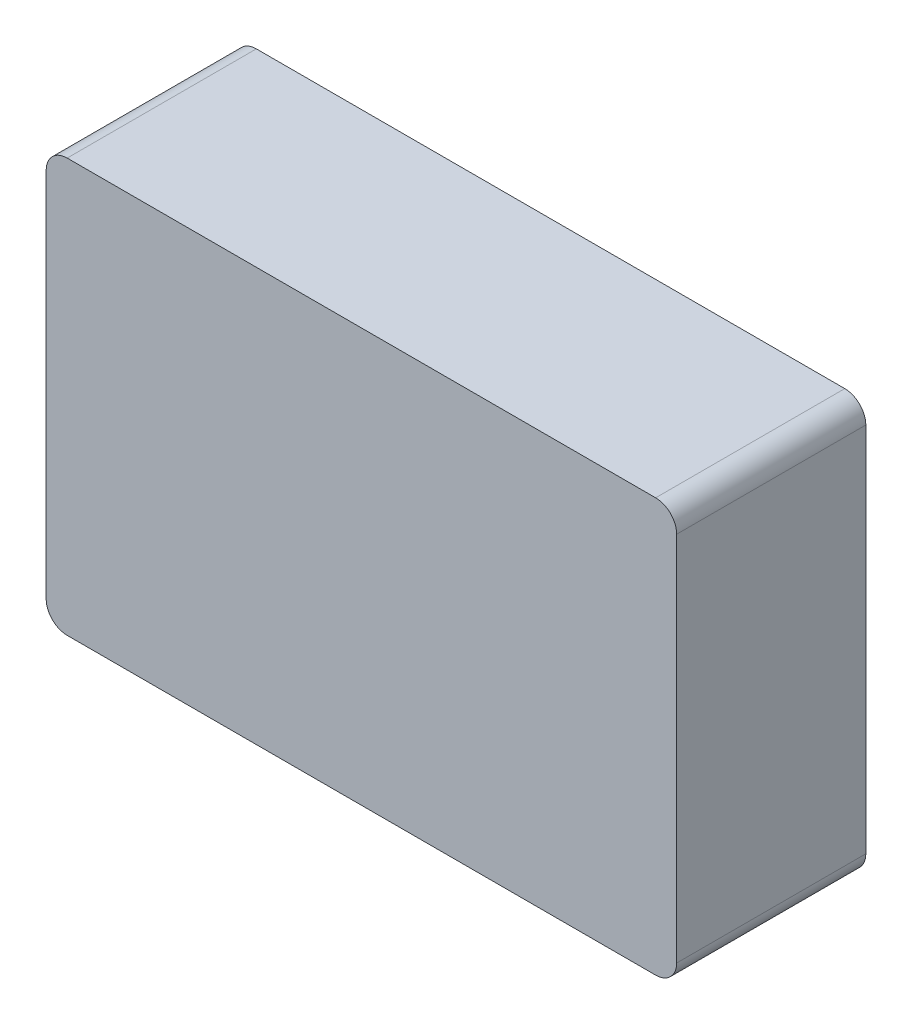
ISO-10303-21;
HEADER;
FILE_DESCRIPTION(('STEP AP214'),'2;1');
FILE_NAME('part.step','',(''),(''),'','','');
FILE_SCHEMA(('AUTOMOTIVE_DESIGN { 1 0 10303 214 1 1 1 1 }'));
ENDSEC;
DATA;
#1=APPLICATION_CONTEXT('core data for automotive mechanical design processes');
#2=APPLICATION_PROTOCOL_DEFINITION('international standard','automotive_design',2000,#1);
#3=PRODUCT_CONTEXT('',#1,'mechanical');
#4=PRODUCT('Part','Part','',(#3));
#5=PRODUCT_RELATED_PRODUCT_CATEGORY('part','',(#4));
#6=PRODUCT_DEFINITION_FORMATION('','',#4);
#7=PRODUCT_DEFINITION_CONTEXT('part definition',#1,'design');
#8=PRODUCT_DEFINITION('design','',#6,#7);
#9=PRODUCT_DEFINITION_SHAPE('','',#8);
#10=(LENGTH_UNIT() NAMED_UNIT(*) SI_UNIT(.MILLI.,.METRE.));
#11=(NAMED_UNIT(*) PLANE_ANGLE_UNIT() SI_UNIT($,.RADIAN.));
#12=(NAMED_UNIT(*) SI_UNIT($,.STERADIAN.) SOLID_ANGLE_UNIT());
#13=UNCERTAINTY_MEASURE_WITH_UNIT(LENGTH_MEASURE(1.E-05),#10,'distance_accuracy_value','');
#14=(GEOMETRIC_REPRESENTATION_CONTEXT(3) GLOBAL_UNCERTAINTY_ASSIGNED_CONTEXT((#13)) GLOBAL_UNIT_ASSIGNED_CONTEXT((#10,
#11,#12)) REPRESENTATION_CONTEXT('',''));
#15=CARTESIAN_POINT('',(0.,0.,0.));
#16=DIRECTION('',(0.,0.,1.));
#17=DIRECTION('',(1.,0.,0.));
#18=AXIS2_PLACEMENT_3D('',#15,#16,#17);
#19=CARTESIAN_POINT('',(-14.,-8.8349613483669,9.));
#20=DIRECTION('',(0.,0.,-1.));
#21=DIRECTION('',(-1.,0.,0.));
#22=AXIS2_PLACEMENT_3D('',#19,#20,#21);
#23=CYLINDRICAL_SURFACE('',#22,0.999999999999999);
#24=CARTESIAN_POINT('',(-14.,-8.8349613483669,0.));
#25=DIRECTION('',(0.,0.,1.));
#26=DIRECTION('',(-1.,0.,0.));
#27=AXIS2_PLACEMENT_3D('',#24,#25,#26);
#28=CIRCLE('',#27,0.999999999999999);
#29=CARTESIAN_POINT('',(-15.,-8.83496134836689,0.));
#30=VERTEX_POINT('',#29);
#31=CARTESIAN_POINT('',(-14.,-9.8349613483669,0.));
#32=VERTEX_POINT('',#31);
#33=EDGE_CURVE('E146',#30,#32,#28,.T.);
#34=ORIENTED_EDGE('',*,*,#33,.T.);
#35=DIRECTION('',(0.,0.,-1.));
#36=VECTOR('',#35,1.);
#37=CARTESIAN_POINT('',(-14.,-9.8349613483669,9.));
#38=LINE('',#37,#36);
#39=CARTESIAN_POINT('',(-14.,-9.8349613483669,9.));
#40=VERTEX_POINT('',#39);
#41=EDGE_CURVE('E11',#40,#32,#38,.T.);
#42=ORIENTED_EDGE('',*,*,#41,.F.);
#43=CARTESIAN_POINT('',(-14.,-8.8349613483669,9.));
#44=DIRECTION('',(0.,0.,1.));
#45=DIRECTION('',(-1.,0.,0.));
#46=AXIS2_PLACEMENT_3D('',#43,#44,#45);
#47=CIRCLE('',#46,0.999999999999999);
#48=CARTESIAN_POINT('',(-15.,-8.83496134836689,9.));
#49=VERTEX_POINT('',#48);
#50=EDGE_CURVE('E168',#49,#40,#47,.T.);
#51=ORIENTED_EDGE('',*,*,#50,.F.);
#52=DIRECTION('',(0.,0.,-1.));
#53=VECTOR('',#52,1.);
#54=CARTESIAN_POINT('',(-15.,-8.83496134836689,9.));
#55=LINE('',#54,#53);
#56=EDGE_CURVE('E142',#49,#30,#55,.T.);
#57=ORIENTED_EDGE('',*,*,#56,.T.);
#58=EDGE_LOOP('',(#34,#42,#51,#57));
#59=FACE_BOUND('',#58,.T.);
#60=ADVANCED_FACE('F45',(#59),#23,.T.);
#61=CARTESIAN_POINT('',(-14.,-9.8349613483669,9.));
#62=DIRECTION('',(0.,1.,0.));
#63=DIRECTION('',(0.,0.,1.));
#64=AXIS2_PLACEMENT_3D('',#61,#62,#63);
#65=PLANE('',#64);
#66=DIRECTION('',(1.,0.,0.));
#67=VECTOR('',#66,1.);
#68=CARTESIAN_POINT('',(-14.,-9.8349613483669,0.));
#69=LINE('',#68,#67);
#70=CARTESIAN_POINT('',(14.,-9.8349613483669,0.));
#71=VERTEX_POINT('',#70);
#72=EDGE_CURVE('E150',#32,#71,#69,.T.);
#73=ORIENTED_EDGE('',*,*,#72,.T.);
#74=DIRECTION('',(0.,0.,-1.));
#75=VECTOR('',#74,1.);
#76=CARTESIAN_POINT('',(14.,-9.8349613483669,9.));
#77=LINE('',#76,#75);
#78=CARTESIAN_POINT('',(14.,-9.8349613483669,9.));
#79=VERTEX_POINT('',#78);
#80=EDGE_CURVE('E54',#79,#71,#77,.T.);
#81=ORIENTED_EDGE('',*,*,#80,.F.);
#82=DIRECTION('',(1.,0.,0.));
#83=VECTOR('',#82,1.);
#84=CARTESIAN_POINT('',(-14.,-9.8349613483669,9.));
#85=LINE('',#84,#83);
#86=EDGE_CURVE('E105',#40,#79,#85,.T.);
#87=ORIENTED_EDGE('',*,*,#86,.F.);
#88=ORIENTED_EDGE('',*,*,#41,.T.);
#89=EDGE_LOOP('',(#73,#81,#87,#88));
#90=FACE_BOUND('',#89,.T.);
#91=ADVANCED_FACE('F214',(#90),#65,.F.);
#92=CARTESIAN_POINT('',(14.,-8.8349613483669,9.));
#93=DIRECTION('',(0.,0.,-1.));
#94=DIRECTION('',(-1.,0.,0.));
#95=AXIS2_PLACEMENT_3D('',#92,#93,#94);
#96=CYLINDRICAL_SURFACE('',#95,0.999999999999999);
#97=CARTESIAN_POINT('',(14.,-8.8349613483669,0.));
#98=DIRECTION('',(0.,0.,1.));
#99=DIRECTION('',(1.,0.,0.));
#100=AXIS2_PLACEMENT_3D('',#97,#98,#99);
#101=CIRCLE('',#100,0.999999999999999);
#102=CARTESIAN_POINT('',(15.,-8.8349613483669,0.));
#103=VERTEX_POINT('',#102);
#104=EDGE_CURVE('E153',#71,#103,#101,.T.);
#105=ORIENTED_EDGE('',*,*,#104,.T.);
#106=DIRECTION('',(0.,0.,-1.));
#107=VECTOR('',#106,1.);
#108=CARTESIAN_POINT('',(15.,-8.8349613483669,9.));
#109=LINE('',#108,#107);
#110=CARTESIAN_POINT('',(15.,-8.8349613483669,9.));
#111=VERTEX_POINT('',#110);
#112=EDGE_CURVE('E179',#111,#103,#109,.T.);
#113=ORIENTED_EDGE('',*,*,#112,.F.);
#114=CARTESIAN_POINT('',(14.,-8.8349613483669,9.));
#115=DIRECTION('',(0.,0.,1.));
#116=DIRECTION('',(1.,0.,0.));
#117=AXIS2_PLACEMENT_3D('',#114,#115,#116);
#118=CIRCLE('',#117,0.999999999999999);
#119=EDGE_CURVE('E189',#79,#111,#118,.T.);
#120=ORIENTED_EDGE('',*,*,#119,.F.);
#121=ORIENTED_EDGE('',*,*,#80,.T.);
#122=EDGE_LOOP('',(#105,#113,#120,#121));
#123=FACE_BOUND('',#122,.T.);
#124=ADVANCED_FACE('F187',(#123),#96,.T.);
#125=CARTESIAN_POINT('',(15.,-8.83496134836689,9.));
#126=DIRECTION('',(-1.,0.,0.));
#127=DIRECTION('',(0.,0.,1.));
#128=AXIS2_PLACEMENT_3D('',#125,#126,#127);
#129=PLANE('',#128);
#130=DIRECTION('',(0.,1.,0.));
#131=VECTOR('',#130,1.);
#132=CARTESIAN_POINT('',(15.,-8.83496134836689,0.));
#133=LINE('',#132,#131);
#134=CARTESIAN_POINT('',(15.,8.83496134836689,0.));
#135=VERTEX_POINT('',#134);
#136=EDGE_CURVE('E156',#103,#135,#133,.T.);
#137=ORIENTED_EDGE('',*,*,#136,.T.);
#138=DIRECTION('',(0.,0.,-1.));
#139=VECTOR('',#138,1.);
#140=CARTESIAN_POINT('',(15.,8.83496134836689,9.));
#141=LINE('',#140,#139);
#142=CARTESIAN_POINT('',(15.,8.83496134836689,9.));
#143=VERTEX_POINT('',#142);
#144=EDGE_CURVE('E175',#143,#135,#141,.T.);
#145=ORIENTED_EDGE('',*,*,#144,.F.);
#146=DIRECTION('',(0.,1.,0.));
#147=VECTOR('',#146,1.);
#148=CARTESIAN_POINT('',(15.,-8.83496134836689,9.));
#149=LINE('',#148,#147);
#150=EDGE_CURVE('E202',#111,#143,#149,.T.);
#151=ORIENTED_EDGE('',*,*,#150,.F.);
#152=ORIENTED_EDGE('',*,*,#112,.T.);
#153=EDGE_LOOP('',(#137,#145,#151,#152));
#154=FACE_BOUND('',#153,.T.);
#155=ADVANCED_FACE('F197',(#154),#129,.F.);
#156=CARTESIAN_POINT('',(14.,8.8349613483669,9.));
#157=DIRECTION('',(0.,0.,-1.));
#158=DIRECTION('',(-1.,0.,0.));
#159=AXIS2_PLACEMENT_3D('',#156,#157,#158);
#160=CYLINDRICAL_SURFACE('',#159,0.999999999999999);
#161=CARTESIAN_POINT('',(14.,8.8349613483669,0.));
#162=DIRECTION('',(0.,0.,1.));
#163=DIRECTION('',(-1.,0.,0.));
#164=AXIS2_PLACEMENT_3D('',#161,#162,#163);
#165=CIRCLE('',#164,0.999999999999999);
#166=CARTESIAN_POINT('',(14.,9.8349613483669,0.));
#167=VERTEX_POINT('',#166);
#168=EDGE_CURVE('E159',#135,#167,#165,.T.);
#169=ORIENTED_EDGE('',*,*,#168,.T.);
#170=DIRECTION('',(0.,0.,-1.));
#171=VECTOR('',#170,1.);
#172=CARTESIAN_POINT('',(14.,9.8349613483669,9.));
#173=LINE('',#172,#171);
#174=CARTESIAN_POINT('',(14.,9.8349613483669,9.));
#175=VERTEX_POINT('',#174);
#176=EDGE_CURVE('E135',#175,#167,#173,.T.);
#177=ORIENTED_EDGE('',*,*,#176,.F.);
#178=CARTESIAN_POINT('',(14.,8.8349613483669,9.));
#179=DIRECTION('',(0.,0.,1.));
#180=DIRECTION('',(-1.,0.,0.));
#181=AXIS2_PLACEMENT_3D('',#178,#179,#180);
#182=CIRCLE('',#181,0.999999999999999);
#183=EDGE_CURVE('E124',#143,#175,#182,.T.);
#184=ORIENTED_EDGE('',*,*,#183,.F.);
#185=ORIENTED_EDGE('',*,*,#144,.T.);
#186=EDGE_LOOP('',(#169,#177,#184,#185));
#187=FACE_BOUND('',#186,.T.);
#188=ADVANCED_FACE('F200',(#187),#160,.T.);
#189=CARTESIAN_POINT('',(-14.,9.8349613483669,9.));
#190=DIRECTION('',(0.,-1.,0.));
#191=DIRECTION('',(0.,0.,-1.));
#192=AXIS2_PLACEMENT_3D('',#189,#190,#191);
#193=PLANE('',#192);
#194=DIRECTION('',(-1.,0.,0.));
#195=VECTOR('',#194,1.);
#196=CARTESIAN_POINT('',(-14.,9.8349613483669,0.));
#197=LINE('',#196,#195);
#198=CARTESIAN_POINT('',(-14.,9.8349613483669,0.));
#199=VERTEX_POINT('',#198);
#200=EDGE_CURVE('E133',#167,#199,#197,.T.);
#201=ORIENTED_EDGE('',*,*,#200,.T.);
#202=DIRECTION('',(0.,0.,-1.));
#203=VECTOR('',#202,1.);
#204=CARTESIAN_POINT('',(-14.,9.8349613483669,9.));
#205=LINE('',#204,#203);
#206=CARTESIAN_POINT('',(-14.,9.8349613483669,9.));
#207=VERTEX_POINT('',#206);
#208=EDGE_CURVE('E130',#207,#199,#205,.T.);
#209=ORIENTED_EDGE('',*,*,#208,.F.);
#210=DIRECTION('',(-1.,0.,0.));
#211=VECTOR('',#210,1.);
#212=CARTESIAN_POINT('',(-14.,9.8349613483669,9.));
#213=LINE('',#212,#211);
#214=EDGE_CURVE('E118',#175,#207,#213,.T.);
#215=ORIENTED_EDGE('',*,*,#214,.F.);
#216=ORIENTED_EDGE('',*,*,#176,.T.);
#217=EDGE_LOOP('',(#201,#209,#215,#216));
#218=FACE_BOUND('',#217,.T.);
#219=ADVANCED_FACE('F131',(#218),#193,.F.);
#220=CARTESIAN_POINT('',(-14.,8.8349613483669,9.));
#221=DIRECTION('',(0.,0.,-1.));
#222=DIRECTION('',(-1.,0.,0.));
#223=AXIS2_PLACEMENT_3D('',#220,#221,#222);
#224=CYLINDRICAL_SURFACE('',#223,0.999999999999999);
#225=CARTESIAN_POINT('',(-14.,8.8349613483669,0.));
#226=DIRECTION('',(0.,0.,1.));
#227=DIRECTION('',(-1.,0.,0.));
#228=AXIS2_PLACEMENT_3D('',#225,#226,#227);
#229=CIRCLE('',#228,0.999999999999999);
#230=CARTESIAN_POINT('',(-15.,8.83496134836689,0.));
#231=VERTEX_POINT('',#230);
#232=EDGE_CURVE('E91',#199,#231,#229,.T.);
#233=ORIENTED_EDGE('',*,*,#232,.T.);
#234=DIRECTION('',(0.,0.,-1.));
#235=VECTOR('',#234,1.);
#236=CARTESIAN_POINT('',(-15.,8.83496134836689,9.));
#237=LINE('',#236,#235);
#238=CARTESIAN_POINT('',(-15.,8.83496134836689,9.));
#239=VERTEX_POINT('',#238);
#240=EDGE_CURVE('E136',#239,#231,#237,.T.);
#241=ORIENTED_EDGE('',*,*,#240,.F.);
#242=CARTESIAN_POINT('',(-14.,8.8349613483669,9.));
#243=DIRECTION('',(0.,0.,1.));
#244=DIRECTION('',(-1.,0.,0.));
#245=AXIS2_PLACEMENT_3D('',#242,#243,#244);
#246=CIRCLE('',#245,0.999999999999999);
#247=EDGE_CURVE('E122',#207,#239,#246,.T.);
#248=ORIENTED_EDGE('',*,*,#247,.F.);
#249=ORIENTED_EDGE('',*,*,#208,.T.);
#250=EDGE_LOOP('',(#233,#241,#248,#249));
#251=FACE_BOUND('',#250,.T.);
#252=ADVANCED_FACE('F138',(#251),#224,.T.);
#253=CARTESIAN_POINT('',(-15.,-8.83496134836689,9.));
#254=DIRECTION('',(1.,0.,0.));
#255=DIRECTION('',(0.,0.,-1.));
#256=AXIS2_PLACEMENT_3D('',#253,#254,#255);
#257=PLANE('',#256);
#258=DIRECTION('',(0.,-1.,0.));
#259=VECTOR('',#258,1.);
#260=CARTESIAN_POINT('',(-15.,-8.83496134836689,0.));
#261=LINE('',#260,#259);
#262=EDGE_CURVE('E97',#231,#30,#261,.T.);
#263=ORIENTED_EDGE('',*,*,#262,.T.);
#264=ORIENTED_EDGE('',*,*,#56,.F.);
#265=DIRECTION('',(0.,-1.,0.));
#266=VECTOR('',#265,1.);
#267=CARTESIAN_POINT('',(-15.,-8.83496134836689,9.));
#268=LINE('',#267,#266);
#269=EDGE_CURVE('E62',#239,#49,#268,.T.);
#270=ORIENTED_EDGE('',*,*,#269,.F.);
#271=ORIENTED_EDGE('',*,*,#240,.T.);
#272=EDGE_LOOP('',(#263,#264,#270,#271));
#273=FACE_BOUND('',#272,.T.);
#274=ADVANCED_FACE('F230',(#273),#257,.F.);
#275=CARTESIAN_POINT('',(-14.,-8.8349613483669,9.));
#276=DIRECTION('',(0.,0.,-1.));
#277=DIRECTION('',(-1.,0.,0.));
#278=AXIS2_PLACEMENT_3D('',#275,#276,#277);
#279=PLANE('',#278);
#280=ORIENTED_EDGE('',*,*,#50,.T.);
#281=ORIENTED_EDGE('',*,*,#86,.T.);
#282=ORIENTED_EDGE('',*,*,#119,.T.);
#283=ORIENTED_EDGE('',*,*,#150,.T.);
#284=ORIENTED_EDGE('',*,*,#183,.T.);
#285=ORIENTED_EDGE('',*,*,#214,.T.);
#286=ORIENTED_EDGE('',*,*,#247,.T.);
#287=ORIENTED_EDGE('',*,*,#269,.T.);
#288=EDGE_LOOP('',(#280,#281,#282,#283,#284,#285,#286,#287));
#289=FACE_BOUND('',#288,.T.);
#290=ADVANCED_FACE('F120',(#289),#279,.F.);
#291=CARTESIAN_POINT('',(-14.,-8.8349613483669,0.));
#292=DIRECTION('',(0.,0.,-1.));
#293=DIRECTION('',(-1.,0.,0.));
#294=AXIS2_PLACEMENT_3D('',#291,#292,#293);
#295=PLANE('',#294);
#296=ORIENTED_EDGE('',*,*,#33,.F.);
#297=ORIENTED_EDGE('',*,*,#262,.F.);
#298=ORIENTED_EDGE('',*,*,#232,.F.);
#299=ORIENTED_EDGE('',*,*,#200,.F.);
#300=ORIENTED_EDGE('',*,*,#168,.F.);
#301=ORIENTED_EDGE('',*,*,#136,.F.);
#302=ORIENTED_EDGE('',*,*,#104,.F.);
#303=ORIENTED_EDGE('',*,*,#72,.F.);
#304=EDGE_LOOP('',(#296,#297,#298,#299,#300,#301,#302,#303));
#305=FACE_BOUND('',#304,.T.);
#306=ADVANCED_FACE('F193',(#305),#295,.T.);
#307=CLOSED_SHELL('',(#60,#91,#124,#155,#188,#219,#252,#274,#290,#306));
#308=MANIFOLD_SOLID_BREP('B2',#307);
#309=ADVANCED_BREP_SHAPE_REPRESENTATION('',(#18,#308),#14);
#310=SHAPE_DEFINITION_REPRESENTATION(#9,#309);
ENDSEC;
END-ISO-10303-21;
